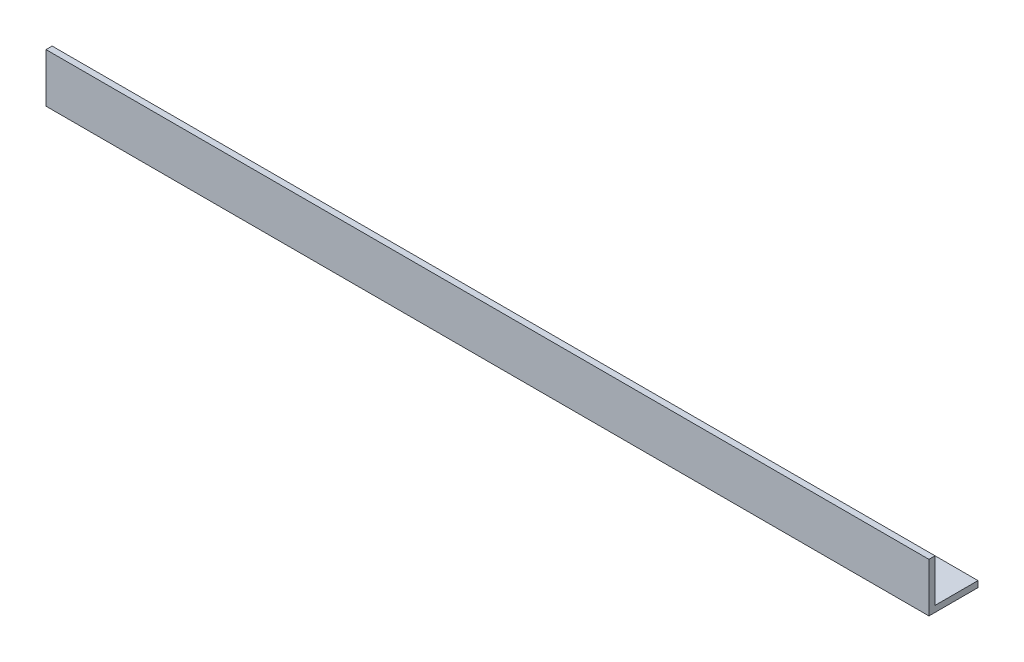
ISO-10303-21;
HEADER;
FILE_DESCRIPTION(('STEP AP214'),'2;1');
FILE_NAME('part.step','',(''),(''),'','','');
FILE_SCHEMA(('AUTOMOTIVE_DESIGN { 1 0 10303 214 1 1 1 1 }'));
ENDSEC;
DATA;
#1=APPLICATION_CONTEXT('core data for automotive mechanical design processes');
#2=APPLICATION_PROTOCOL_DEFINITION('international standard','automotive_design',2000,#1);
#3=PRODUCT_CONTEXT('',#1,'mechanical');
#4=PRODUCT('Part','Part','',(#3));
#5=PRODUCT_RELATED_PRODUCT_CATEGORY('part','',(#4));
#6=PRODUCT_DEFINITION_FORMATION('','',#4);
#7=PRODUCT_DEFINITION_CONTEXT('part definition',#1,'design');
#8=PRODUCT_DEFINITION('design','',#6,#7);
#9=PRODUCT_DEFINITION_SHAPE('','',#8);
#10=(LENGTH_UNIT() NAMED_UNIT(*) SI_UNIT(.MILLI.,.METRE.));
#11=(NAMED_UNIT(*) PLANE_ANGLE_UNIT() SI_UNIT($,.RADIAN.));
#12=(NAMED_UNIT(*) SI_UNIT($,.STERADIAN.) SOLID_ANGLE_UNIT());
#13=UNCERTAINTY_MEASURE_WITH_UNIT(LENGTH_MEASURE(1.E-05),#10,'distance_accuracy_value','');
#14=(GEOMETRIC_REPRESENTATION_CONTEXT(3) GLOBAL_UNCERTAINTY_ASSIGNED_CONTEXT((#13)) GLOBAL_UNIT_ASSIGNED_CONTEXT((#10,
#11,#12)) REPRESENTATION_CONTEXT('',''));
#15=CARTESIAN_POINT('',(0.,0.,0.));
#16=DIRECTION('',(0.,0.,1.));
#17=DIRECTION('',(1.,0.,0.));
#18=AXIS2_PLACEMENT_3D('',#15,#16,#17);
#19=CARTESIAN_POINT('',(228.6,0.,-25.4000000000001));
#20=DIRECTION('',(0.,1.,0.));
#21=DIRECTION('',(0.,0.,1.));
#22=AXIS2_PLACEMENT_3D('',#19,#20,#21);
#23=PLANE('',#22);
#24=DIRECTION('',(0.,0.,-1.));
#25=VECTOR('',#24,1.);
#26=CARTESIAN_POINT('',(-228.6,0.,-25.4000000000001));
#27=LINE('',#26,#25);
#28=CARTESIAN_POINT('',(-228.6,0.,0.));
#29=VERTEX_POINT('',#28);
#30=CARTESIAN_POINT('',(-228.6,0.,-25.4000000000001));
#31=VERTEX_POINT('',#30);
#32=EDGE_CURVE('E144',#29,#31,#27,.T.);
#33=ORIENTED_EDGE('',*,*,#32,.T.);
#34=DIRECTION('',(-1.,0.,0.));
#35=VECTOR('',#34,1.);
#36=CARTESIAN_POINT('',(228.6,0.,-25.4000000000001));
#37=LINE('',#36,#35);
#38=CARTESIAN_POINT('',(228.6,0.,-25.4000000000001));
#39=VERTEX_POINT('',#38);
#40=EDGE_CURVE('E11',#39,#31,#37,.T.);
#41=ORIENTED_EDGE('',*,*,#40,.F.);
#42=DIRECTION('',(0.,0.,-1.));
#43=VECTOR('',#42,1.);
#44=CARTESIAN_POINT('',(228.6,0.,-25.4000000000001));
#45=LINE('',#44,#43);
#46=CARTESIAN_POINT('',(228.6,0.,0.));
#47=VERTEX_POINT('',#46);
#48=EDGE_CURVE('E160',#47,#39,#45,.T.);
#49=ORIENTED_EDGE('',*,*,#48,.F.);
#50=DIRECTION('',(-1.,0.,0.));
#51=VECTOR('',#50,1.);
#52=CARTESIAN_POINT('',(228.6,0.,0.));
#53=LINE('',#52,#51);
#54=EDGE_CURVE('E140',#47,#29,#53,.T.);
#55=ORIENTED_EDGE('',*,*,#54,.T.);
#56=EDGE_LOOP('',(#33,#41,#49,#55));
#57=FACE_BOUND('',#56,.T.);
#58=ADVANCED_FACE('F42',(#57),#23,.F.);
#59=CARTESIAN_POINT('',(228.6,3.17499999999987,-25.4));
#60=DIRECTION('',(0.,0.,1.));
#61=DIRECTION('',(1.,0.,0.));
#62=AXIS2_PLACEMENT_3D('',#59,#60,#61);
#63=PLANE('',#62);
#64=DIRECTION('',(0.,1.,0.));
#65=VECTOR('',#64,1.);
#66=CARTESIAN_POINT('',(-228.6,3.17499999999998,-25.4));
#67=LINE('',#66,#65);
#68=CARTESIAN_POINT('',(-228.6,3.17499999999998,-25.4));
#69=VERTEX_POINT('',#68);
#70=EDGE_CURVE('E148',#31,#69,#67,.T.);
#71=ORIENTED_EDGE('',*,*,#70,.T.);
#72=DIRECTION('',(-1.,0.,0.));
#73=VECTOR('',#72,1.);
#74=CARTESIAN_POINT('',(228.6,3.17499999999987,-25.4));
#75=LINE('',#74,#73);
#76=CARTESIAN_POINT('',(228.6,3.17499999999987,-25.4));
#77=VERTEX_POINT('',#76);
#78=EDGE_CURVE('E51',#77,#69,#75,.T.);
#79=ORIENTED_EDGE('',*,*,#78,.F.);
#80=DIRECTION('',(0.,1.,0.));
#81=VECTOR('',#80,1.);
#82=CARTESIAN_POINT('',(228.6,3.17499999999987,-25.4));
#83=LINE('',#82,#81);
#84=EDGE_CURVE('E107',#39,#77,#83,.T.);
#85=ORIENTED_EDGE('',*,*,#84,.F.);
#86=ORIENTED_EDGE('',*,*,#40,.T.);
#87=EDGE_LOOP('',(#71,#79,#85,#86));
#88=FACE_BOUND('',#87,.T.);
#89=ADVANCED_FACE('F189',(#88),#63,.F.);
#90=CARTESIAN_POINT('',(228.6,3.17499999999987,-3.17499999999987));
#91=DIRECTION('',(0.,-1.,0.));
#92=DIRECTION('',(0.,0.,-1.));
#93=AXIS2_PLACEMENT_3D('',#90,#91,#92);
#94=PLANE('',#93);
#95=DIRECTION('',(0.,0.,1.));
#96=VECTOR('',#95,1.);
#97=CARTESIAN_POINT('',(-228.6,3.17499999999998,-3.17499999999987));
#98=LINE('',#97,#96);
#99=CARTESIAN_POINT('',(-228.6,3.17499999999998,-3.17499999999987));
#100=VERTEX_POINT('',#99);
#101=EDGE_CURVE('E151',#69,#100,#98,.T.);
#102=ORIENTED_EDGE('',*,*,#101,.T.);
#103=DIRECTION('',(-1.,0.,0.));
#104=VECTOR('',#103,1.);
#105=CARTESIAN_POINT('',(228.6,3.17499999999987,-3.17499999999987));
#106=LINE('',#105,#104);
#107=CARTESIAN_POINT('',(228.6,3.17499999999987,-3.17499999999987));
#108=VERTEX_POINT('',#107);
#109=EDGE_CURVE('E132',#108,#100,#106,.T.);
#110=ORIENTED_EDGE('',*,*,#109,.F.);
#111=DIRECTION('',(0.,0.,1.));
#112=VECTOR('',#111,1.);
#113=CARTESIAN_POINT('',(228.6,3.17499999999987,-3.17499999999987));
#114=LINE('',#113,#112);
#115=EDGE_CURVE('E121',#77,#108,#114,.T.);
#116=ORIENTED_EDGE('',*,*,#115,.F.);
#117=ORIENTED_EDGE('',*,*,#78,.T.);
#118=EDGE_LOOP('',(#102,#110,#116,#117));
#119=FACE_BOUND('',#118,.T.);
#120=ADVANCED_FACE('F171',(#119),#94,.F.);
#121=CARTESIAN_POINT('',(228.6,25.4000000000001,-3.17499999999987));
#122=DIRECTION('',(0.,0.,1.));
#123=DIRECTION('',(0.,-1.,0.));
#124=AXIS2_PLACEMENT_3D('',#121,#122,#123);
#125=PLANE('',#124);
#126=DIRECTION('',(0.,1.,0.));
#127=VECTOR('',#126,1.);
#128=CARTESIAN_POINT('',(-228.6,25.4000000000001,-3.17499999999987));
#129=LINE('',#128,#127);
#130=CARTESIAN_POINT('',(-228.6,25.4000000000001,-3.17499999999987));
#131=VERTEX_POINT('',#130);
#132=EDGE_CURVE('E130',#100,#131,#129,.T.);
#133=ORIENTED_EDGE('',*,*,#132,.T.);
#134=DIRECTION('',(-1.,0.,0.));
#135=VECTOR('',#134,1.);
#136=CARTESIAN_POINT('',(228.6,25.4000000000001,-3.17499999999987));
#137=LINE('',#136,#135);
#138=CARTESIAN_POINT('',(228.6,25.4000000000001,-3.17499999999987));
#139=VERTEX_POINT('',#138);
#140=EDGE_CURVE('E127',#139,#131,#137,.T.);
#141=ORIENTED_EDGE('',*,*,#140,.F.);
#142=DIRECTION('',(0.,1.,0.));
#143=VECTOR('',#142,1.);
#144=CARTESIAN_POINT('',(228.6,25.4000000000001,-3.17499999999987));
#145=LINE('',#144,#143);
#146=EDGE_CURVE('E115',#108,#139,#145,.T.);
#147=ORIENTED_EDGE('',*,*,#146,.F.);
#148=ORIENTED_EDGE('',*,*,#109,.T.);
#149=EDGE_LOOP('',(#133,#141,#147,#148));
#150=FACE_BOUND('',#149,.T.);
#151=ADVANCED_FACE('F128',(#150),#125,.F.);
#152=CARTESIAN_POINT('',(228.6,25.4000000000001,0.));
#153=DIRECTION('',(0.,-1.,0.));
#154=DIRECTION('',(0.,0.,-1.));
#155=AXIS2_PLACEMENT_3D('',#152,#153,#154);
#156=PLANE('',#155);
#157=DIRECTION('',(0.,0.,1.));
#158=VECTOR('',#157,1.);
#159=CARTESIAN_POINT('',(-228.6,25.4000000000001,0.));
#160=LINE('',#159,#158);
#161=CARTESIAN_POINT('',(-228.6,25.4000000000001,0.));
#162=VERTEX_POINT('',#161);
#163=EDGE_CURVE('E90',#131,#162,#160,.T.);
#164=ORIENTED_EDGE('',*,*,#163,.T.);
#165=DIRECTION('',(-1.,0.,0.));
#166=VECTOR('',#165,1.);
#167=CARTESIAN_POINT('',(228.6,25.4000000000001,0.));
#168=LINE('',#167,#166);
#169=CARTESIAN_POINT('',(228.6,25.4000000000001,0.));
#170=VERTEX_POINT('',#169);
#171=EDGE_CURVE('E133',#170,#162,#168,.T.);
#172=ORIENTED_EDGE('',*,*,#171,.F.);
#173=DIRECTION('',(0.,0.,1.));
#174=VECTOR('',#173,1.);
#175=CARTESIAN_POINT('',(228.6,25.4000000000001,0.));
#176=LINE('',#175,#174);
#177=EDGE_CURVE('E119',#139,#170,#176,.T.);
#178=ORIENTED_EDGE('',*,*,#177,.F.);
#179=ORIENTED_EDGE('',*,*,#140,.T.);
#180=EDGE_LOOP('',(#164,#172,#178,#179));
#181=FACE_BOUND('',#180,.T.);
#182=ADVANCED_FACE('F135',(#181),#156,.F.);
#183=CARTESIAN_POINT('',(228.6,0.,0.));
#184=DIRECTION('',(0.,0.,-1.));
#185=DIRECTION('',(-1.,0.,0.));
#186=AXIS2_PLACEMENT_3D('',#183,#184,#185);
#187=PLANE('',#186);
#188=DIRECTION('',(0.,-1.,0.));
#189=VECTOR('',#188,1.);
#190=CARTESIAN_POINT('',(-228.6,0.,0.));
#191=LINE('',#190,#189);
#192=EDGE_CURVE('E97',#162,#29,#191,.T.);
#193=ORIENTED_EDGE('',*,*,#192,.T.);
#194=ORIENTED_EDGE('',*,*,#54,.F.);
#195=DIRECTION('',(0.,-1.,0.));
#196=VECTOR('',#195,1.);
#197=CARTESIAN_POINT('',(228.6,0.,0.));
#198=LINE('',#197,#196);
#199=EDGE_CURVE('E61',#170,#47,#198,.T.);
#200=ORIENTED_EDGE('',*,*,#199,.F.);
#201=ORIENTED_EDGE('',*,*,#171,.T.);
#202=EDGE_LOOP('',(#193,#194,#200,#201));
#203=FACE_BOUND('',#202,.T.);
#204=ADVANCED_FACE('F178',(#203),#187,.F.);
#205=CARTESIAN_POINT('',(228.6,0.,0.));
#206=DIRECTION('',(-1.,0.,0.));
#207=DIRECTION('',(0.,0.,1.));
#208=AXIS2_PLACEMENT_3D('',#205,#206,#207);
#209=PLANE('',#208);
#210=ORIENTED_EDGE('',*,*,#48,.T.);
#211=ORIENTED_EDGE('',*,*,#84,.T.);
#212=ORIENTED_EDGE('',*,*,#115,.T.);
#213=ORIENTED_EDGE('',*,*,#146,.T.);
#214=ORIENTED_EDGE('',*,*,#177,.T.);
#215=ORIENTED_EDGE('',*,*,#199,.T.);
#216=EDGE_LOOP('',(#210,#211,#212,#213,#214,#215));
#217=FACE_BOUND('',#216,.T.);
#218=ADVANCED_FACE('F117',(#217),#209,.F.);
#219=CARTESIAN_POINT('',(-228.6,0.,0.));
#220=DIRECTION('',(-1.,0.,0.));
#221=DIRECTION('',(0.,0.,1.));
#222=AXIS2_PLACEMENT_3D('',#219,#220,#221);
#223=PLANE('',#222);
#224=ORIENTED_EDGE('',*,*,#32,.F.);
#225=ORIENTED_EDGE('',*,*,#192,.F.);
#226=ORIENTED_EDGE('',*,*,#163,.F.);
#227=ORIENTED_EDGE('',*,*,#132,.F.);
#228=ORIENTED_EDGE('',*,*,#101,.F.);
#229=ORIENTED_EDGE('',*,*,#70,.F.);
#230=EDGE_LOOP('',(#224,#225,#226,#227,#228,#229));
#231=FACE_BOUND('',#230,.T.);
#232=ADVANCED_FACE('F174',(#231),#223,.T.);
#233=CLOSED_SHELL('',(#58,#89,#120,#151,#182,#204,#218,#232));
#234=MANIFOLD_SOLID_BREP('B2',#233);
#235=ADVANCED_BREP_SHAPE_REPRESENTATION('',(#18,#234),#14);
#236=SHAPE_DEFINITION_REPRESENTATION(#9,#235);
ENDSEC;
END-ISO-10303-21;
